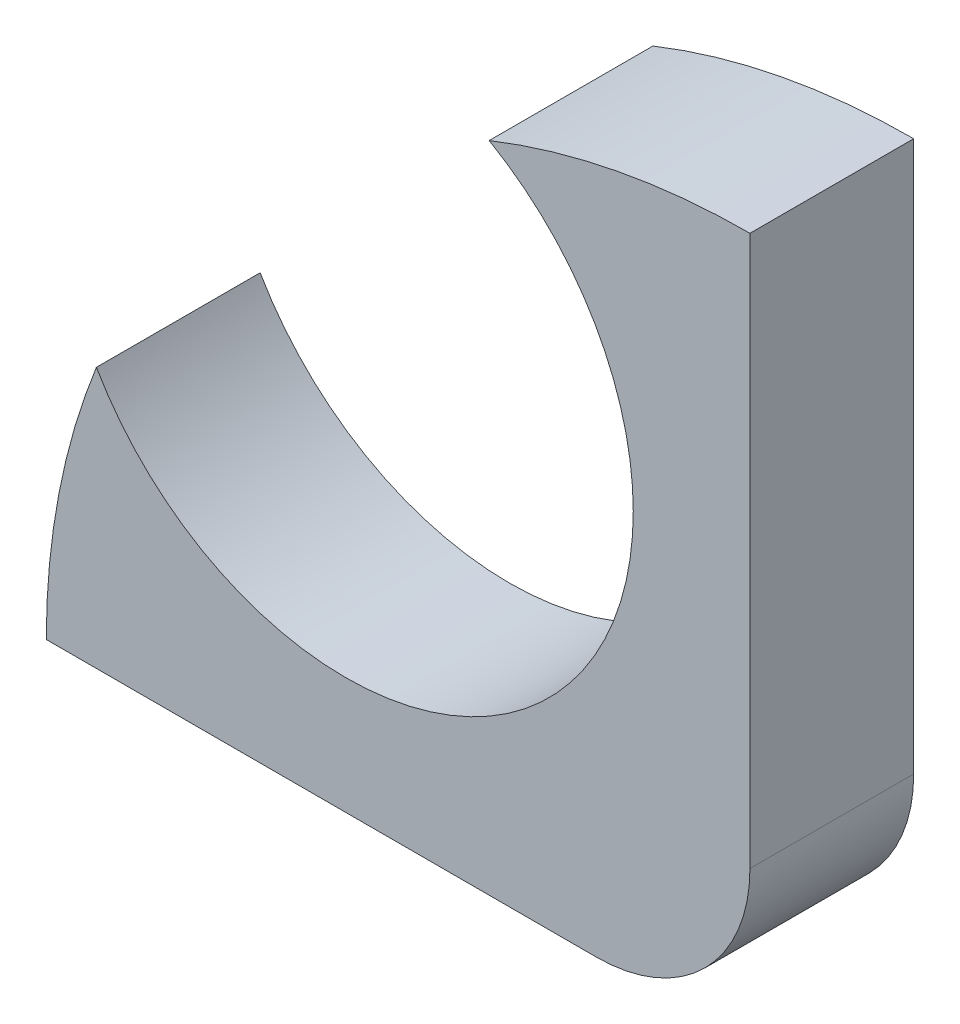
ISO-10303-21;
HEADER;
FILE_DESCRIPTION(('STEP AP214'),'2;1');
FILE_NAME('part.step','',(''),(''),'','','');
FILE_SCHEMA(('AUTOMOTIVE_DESIGN { 1 0 10303 214 1 1 1 1 }'));
ENDSEC;
DATA;
#1=APPLICATION_CONTEXT('core data for automotive mechanical design processes');
#2=APPLICATION_PROTOCOL_DEFINITION('international standard','automotive_design',2000,#1);
#3=PRODUCT_CONTEXT('',#1,'mechanical');
#4=PRODUCT('Part','Part','',(#3));
#5=PRODUCT_RELATED_PRODUCT_CATEGORY('part','',(#4));
#6=PRODUCT_DEFINITION_FORMATION('','',#4);
#7=PRODUCT_DEFINITION_CONTEXT('part definition',#1,'design');
#8=PRODUCT_DEFINITION('design','',#6,#7);
#9=PRODUCT_DEFINITION_SHAPE('','',#8);
#10=(LENGTH_UNIT() NAMED_UNIT(*) SI_UNIT(.MILLI.,.METRE.));
#11=(NAMED_UNIT(*) PLANE_ANGLE_UNIT() SI_UNIT($,.RADIAN.));
#12=(NAMED_UNIT(*) SI_UNIT($,.STERADIAN.) SOLID_ANGLE_UNIT());
#13=UNCERTAINTY_MEASURE_WITH_UNIT(LENGTH_MEASURE(1.E-05),#10,'distance_accuracy_value','');
#14=(GEOMETRIC_REPRESENTATION_CONTEXT(3) GLOBAL_UNCERTAINTY_ASSIGNED_CONTEXT((#13)) GLOBAL_UNIT_ASSIGNED_CONTEXT((#10,
#11,#12)) REPRESENTATION_CONTEXT('',''));
#15=CARTESIAN_POINT('',(0.,0.,0.));
#16=DIRECTION('',(0.,0.,1.));
#17=DIRECTION('',(1.,0.,0.));
#18=AXIS2_PLACEMENT_3D('',#15,#16,#17);
#19=CARTESIAN_POINT('',(19.95,-19.95,18.95));
#20=DIRECTION('',(0.,0.,1.));
#21=DIRECTION('',(1.,0.,0.));
#22=AXIS2_PLACEMENT_3D('',#19,#20,#21);
#23=PLANE('',#22);
#24=CARTESIAN_POINT('',(19.95,-19.95,18.95));
#25=DIRECTION('',(0.,0.,1.));
#26=DIRECTION('',(1.,0.,0.));
#27=AXIS2_PLACEMENT_3D('',#24,#25,#26);
#28=CIRCLE('',#27,6.875);
#29=CARTESIAN_POINT('',(13.5646574803851,-17.4018583423997,18.95));
#30=VERTEX_POINT('',#29);
#31=CARTESIAN_POINT('',(13.075,-19.95,18.95));
#32=VERTEX_POINT('',#31);
#33=EDGE_CURVE('E136',#30,#32,#28,.T.);
#34=ORIENTED_EDGE('',*,*,#33,.F.);
#35=CARTESIAN_POINT('',(16.,-16.,18.95));
#36=DIRECTION('',(0.,0.,-1.));
#37=DIRECTION('',(1.,0.,0.));
#38=AXIS2_PLACEMENT_3D('',#35,#36,#37);
#39=CIRCLE('',#38,2.81);
#40=CARTESIAN_POINT('',(17.4018583423997,-13.5646574803851,18.95));
#41=VERTEX_POINT('',#40);
#42=EDGE_CURVE('E27',#41,#30,#39,.T.);
#43=ORIENTED_EDGE('',*,*,#42,.F.);
#44=CARTESIAN_POINT('',(19.95,-19.95,18.95));
#45=DIRECTION('',(0.,0.,1.));
#46=DIRECTION('',(1.,0.,0.));
#47=AXIS2_PLACEMENT_3D('',#44,#45,#46);
#48=CIRCLE('',#47,6.875);
#49=CARTESIAN_POINT('',(19.95,-13.075,18.95));
#50=VERTEX_POINT('',#49);
#51=EDGE_CURVE('E97',#50,#41,#48,.T.);
#52=ORIENTED_EDGE('',*,*,#51,.F.);
#53=DIRECTION('',(0.,1.,0.));
#54=VECTOR('',#53,1.);
#55=CARTESIAN_POINT('',(19.95,-18.45,18.95));
#56=LINE('',#55,#54);
#57=CARTESIAN_POINT('',(19.95,-18.45,18.95));
#58=VERTEX_POINT('',#57);
#59=EDGE_CURVE('E108',#58,#50,#56,.T.);
#60=ORIENTED_EDGE('',*,*,#59,.F.);
#61=CARTESIAN_POINT('',(18.45,-18.45,18.95));
#62=DIRECTION('',(0.,0.,1.));
#63=DIRECTION('',(1.,0.,0.));
#64=AXIS2_PLACEMENT_3D('',#61,#62,#63);
#65=CIRCLE('',#64,1.5);
#66=CARTESIAN_POINT('',(18.45,-19.95,18.95));
#67=VERTEX_POINT('',#66);
#68=EDGE_CURVE('E20',#67,#58,#65,.T.);
#69=ORIENTED_EDGE('',*,*,#68,.F.);
#70=DIRECTION('',(1.,0.,0.));
#71=VECTOR('',#70,1.);
#72=CARTESIAN_POINT('',(13.075,-19.95,18.95));
#73=LINE('',#72,#71);
#74=EDGE_CURVE('E127',#32,#67,#73,.T.);
#75=ORIENTED_EDGE('',*,*,#74,.F.);
#76=EDGE_LOOP('',(#34,#43,#52,#60,#69,#75));
#77=FACE_BOUND('',#76,.T.);
#78=ADVANCED_FACE('F16',(#77),#23,.F.);
#79=CARTESIAN_POINT('',(19.95,-19.95,20.55));
#80=DIRECTION('',(0.,0.,1.));
#81=DIRECTION('',(1.,0.,0.));
#82=AXIS2_PLACEMENT_3D('',#79,#80,#81);
#83=PLANE('',#82);
#84=CARTESIAN_POINT('',(19.95,-19.95,20.55));
#85=DIRECTION('',(0.,0.,1.));
#86=DIRECTION('',(1.,0.,0.));
#87=AXIS2_PLACEMENT_3D('',#84,#85,#86);
#88=CIRCLE('',#87,6.875);
#89=CARTESIAN_POINT('',(13.5646574803851,-17.4018583423997,20.55));
#90=VERTEX_POINT('',#89);
#91=CARTESIAN_POINT('',(13.075,-19.95,20.55));
#92=VERTEX_POINT('',#91);
#93=EDGE_CURVE('E128',#90,#92,#88,.T.);
#94=ORIENTED_EDGE('',*,*,#93,.T.);
#95=DIRECTION('',(1.,0.,0.));
#96=VECTOR('',#95,1.);
#97=CARTESIAN_POINT('',(13.075,-19.95,20.55));
#98=LINE('',#97,#96);
#99=CARTESIAN_POINT('',(18.45,-19.95,20.55));
#100=VERTEX_POINT('',#99);
#101=EDGE_CURVE('E103',#92,#100,#98,.T.);
#102=ORIENTED_EDGE('',*,*,#101,.T.);
#103=CARTESIAN_POINT('',(18.45,-18.45,20.55));
#104=DIRECTION('',(0.,0.,1.));
#105=DIRECTION('',(1.,0.,0.));
#106=AXIS2_PLACEMENT_3D('',#103,#104,#105);
#107=CIRCLE('',#106,1.5);
#108=CARTESIAN_POINT('',(19.95,-18.45,20.55));
#109=VERTEX_POINT('',#108);
#110=EDGE_CURVE('E100',#100,#109,#107,.T.);
#111=ORIENTED_EDGE('',*,*,#110,.T.);
#112=DIRECTION('',(0.,1.,0.));
#113=VECTOR('',#112,1.);
#114=CARTESIAN_POINT('',(19.95,-18.45,20.55));
#115=LINE('',#114,#113);
#116=CARTESIAN_POINT('',(19.95,-13.075,20.55));
#117=VERTEX_POINT('',#116);
#118=EDGE_CURVE('E86',#109,#117,#115,.T.);
#119=ORIENTED_EDGE('',*,*,#118,.T.);
#120=CARTESIAN_POINT('',(19.95,-19.95,20.55));
#121=DIRECTION('',(0.,0.,1.));
#122=DIRECTION('',(1.,0.,0.));
#123=AXIS2_PLACEMENT_3D('',#120,#121,#122);
#124=CIRCLE('',#123,6.875);
#125=CARTESIAN_POINT('',(17.4018583423997,-13.5646574803851,20.55));
#126=VERTEX_POINT('',#125);
#127=EDGE_CURVE('E131',#117,#126,#124,.T.);
#128=ORIENTED_EDGE('',*,*,#127,.T.);
#129=CARTESIAN_POINT('',(16.,-16.,20.55));
#130=DIRECTION('',(0.,0.,-1.));
#131=DIRECTION('',(1.,0.,0.));
#132=AXIS2_PLACEMENT_3D('',#129,#130,#131);
#133=CIRCLE('',#132,2.81);
#134=EDGE_CURVE('E11',#126,#90,#133,.T.);
#135=ORIENTED_EDGE('',*,*,#134,.T.);
#136=EDGE_LOOP('',(#94,#102,#111,#119,#128,#135));
#137=FACE_BOUND('',#136,.T.);
#138=ADVANCED_FACE('F102',(#137),#83,.T.);
#139=CARTESIAN_POINT('',(16.,-16.,20.55));
#140=DIRECTION('',(0.,0.,-1.));
#141=DIRECTION('',(-1.,0.,0.));
#142=AXIS2_PLACEMENT_3D('',#139,#140,#141);
#143=CYLINDRICAL_SURFACE('',#142,2.81);
#144=ORIENTED_EDGE('',*,*,#42,.T.);
#145=DIRECTION('',(0.,0.,-1.));
#146=VECTOR('',#145,1.);
#147=CARTESIAN_POINT('',(13.5646574803851,-17.4018583423997,20.55));
#148=LINE('',#147,#146);
#149=EDGE_CURVE('E123',#90,#30,#148,.T.);
#150=ORIENTED_EDGE('',*,*,#149,.F.);
#151=ORIENTED_EDGE('',*,*,#134,.F.);
#152=DIRECTION('',(0.,0.,-1.));
#153=VECTOR('',#152,1.);
#154=CARTESIAN_POINT('',(17.4018583423997,-13.5646574803851,20.55));
#155=LINE('',#154,#153);
#156=EDGE_CURVE('E122',#126,#41,#155,.T.);
#157=ORIENTED_EDGE('',*,*,#156,.T.);
#158=EDGE_LOOP('',(#144,#150,#151,#157));
#159=FACE_BOUND('',#158,.T.);
#160=ADVANCED_FACE('F167',(#159),#143,.F.);
#161=CARTESIAN_POINT('',(19.95,-19.95,20.55));
#162=DIRECTION('',(0.,0.,-1.));
#163=DIRECTION('',(-1.,0.,0.));
#164=AXIS2_PLACEMENT_3D('',#161,#162,#163);
#165=CYLINDRICAL_SURFACE('',#164,6.875);
#166=ORIENTED_EDGE('',*,*,#51,.T.);
#167=ORIENTED_EDGE('',*,*,#156,.F.);
#168=ORIENTED_EDGE('',*,*,#127,.F.);
#169=DIRECTION('',(0.,0.,-1.));
#170=VECTOR('',#169,1.);
#171=CARTESIAN_POINT('',(19.95,-13.075,20.55));
#172=LINE('',#171,#170);
#173=EDGE_CURVE('E94',#117,#50,#172,.T.);
#174=ORIENTED_EDGE('',*,*,#173,.T.);
#175=EDGE_LOOP('',(#166,#167,#168,#174));
#176=FACE_BOUND('',#175,.T.);
#177=ADVANCED_FACE('F18',(#176),#165,.T.);
#178=CARTESIAN_POINT('',(19.95,-18.45,20.55));
#179=DIRECTION('',(-1.,0.,0.));
#180=DIRECTION('',(0.,0.,1.));
#181=AXIS2_PLACEMENT_3D('',#178,#179,#180);
#182=PLANE('',#181);
#183=ORIENTED_EDGE('',*,*,#59,.T.);
#184=ORIENTED_EDGE('',*,*,#173,.F.);
#185=ORIENTED_EDGE('',*,*,#118,.F.);
#186=DIRECTION('',(0.,0.,-1.));
#187=VECTOR('',#186,1.);
#188=CARTESIAN_POINT('',(19.95,-18.45,20.55));
#189=LINE('',#188,#187);
#190=EDGE_CURVE('E91',#109,#58,#189,.T.);
#191=ORIENTED_EDGE('',*,*,#190,.T.);
#192=EDGE_LOOP('',(#183,#184,#185,#191));
#193=FACE_BOUND('',#192,.T.);
#194=ADVANCED_FACE('F89',(#193),#182,.F.);
#195=CARTESIAN_POINT('',(18.45,-18.45,20.55));
#196=DIRECTION('',(0.,0.,-1.));
#197=DIRECTION('',(-1.,0.,0.));
#198=AXIS2_PLACEMENT_3D('',#195,#196,#197);
#199=CYLINDRICAL_SURFACE('',#198,1.5);
#200=ORIENTED_EDGE('',*,*,#68,.T.);
#201=ORIENTED_EDGE('',*,*,#190,.F.);
#202=ORIENTED_EDGE('',*,*,#110,.F.);
#203=DIRECTION('',(0.,0.,-1.));
#204=VECTOR('',#203,1.);
#205=CARTESIAN_POINT('',(18.45,-19.95,20.55));
#206=LINE('',#205,#204);
#207=EDGE_CURVE('E135',#100,#67,#206,.T.);
#208=ORIENTED_EDGE('',*,*,#207,.T.);
#209=EDGE_LOOP('',(#200,#201,#202,#208));
#210=FACE_BOUND('',#209,.T.);
#211=ADVANCED_FACE('F110',(#210),#199,.T.);
#212=CARTESIAN_POINT('',(13.075,-19.95,20.55));
#213=DIRECTION('',(0.,1.,0.));
#214=DIRECTION('',(1.,0.,0.));
#215=AXIS2_PLACEMENT_3D('',#212,#213,#214);
#216=PLANE('',#215);
#217=ORIENTED_EDGE('',*,*,#74,.T.);
#218=ORIENTED_EDGE('',*,*,#207,.F.);
#219=ORIENTED_EDGE('',*,*,#101,.F.);
#220=DIRECTION('',(0.,0.,-1.));
#221=VECTOR('',#220,1.);
#222=CARTESIAN_POINT('',(13.075,-19.95,20.55));
#223=LINE('',#222,#221);
#224=EDGE_CURVE('E140',#92,#32,#223,.T.);
#225=ORIENTED_EDGE('',*,*,#224,.T.);
#226=EDGE_LOOP('',(#217,#218,#219,#225));
#227=FACE_BOUND('',#226,.T.);
#228=ADVANCED_FACE('F187',(#227),#216,.F.);
#229=CARTESIAN_POINT('',(19.95,-19.95,20.55));
#230=DIRECTION('',(0.,0.,-1.));
#231=DIRECTION('',(-1.,0.,0.));
#232=AXIS2_PLACEMENT_3D('',#229,#230,#231);
#233=CYLINDRICAL_SURFACE('',#232,6.875);
#234=ORIENTED_EDGE('',*,*,#33,.T.);
#235=ORIENTED_EDGE('',*,*,#224,.F.);
#236=ORIENTED_EDGE('',*,*,#93,.F.);
#237=ORIENTED_EDGE('',*,*,#149,.T.);
#238=EDGE_LOOP('',(#234,#235,#236,#237));
#239=FACE_BOUND('',#238,.T.);
#240=ADVANCED_FACE('F185',(#239),#233,.T.);
#241=CLOSED_SHELL('',(#78,#138,#160,#177,#194,#211,#228,#240));
#242=MANIFOLD_SOLID_BREP('B1',#241);
#243=ADVANCED_BREP_SHAPE_REPRESENTATION('',(#18,#242),#14);
#244=SHAPE_DEFINITION_REPRESENTATION(#9,#243);
ENDSEC;
END-ISO-10303-21;
